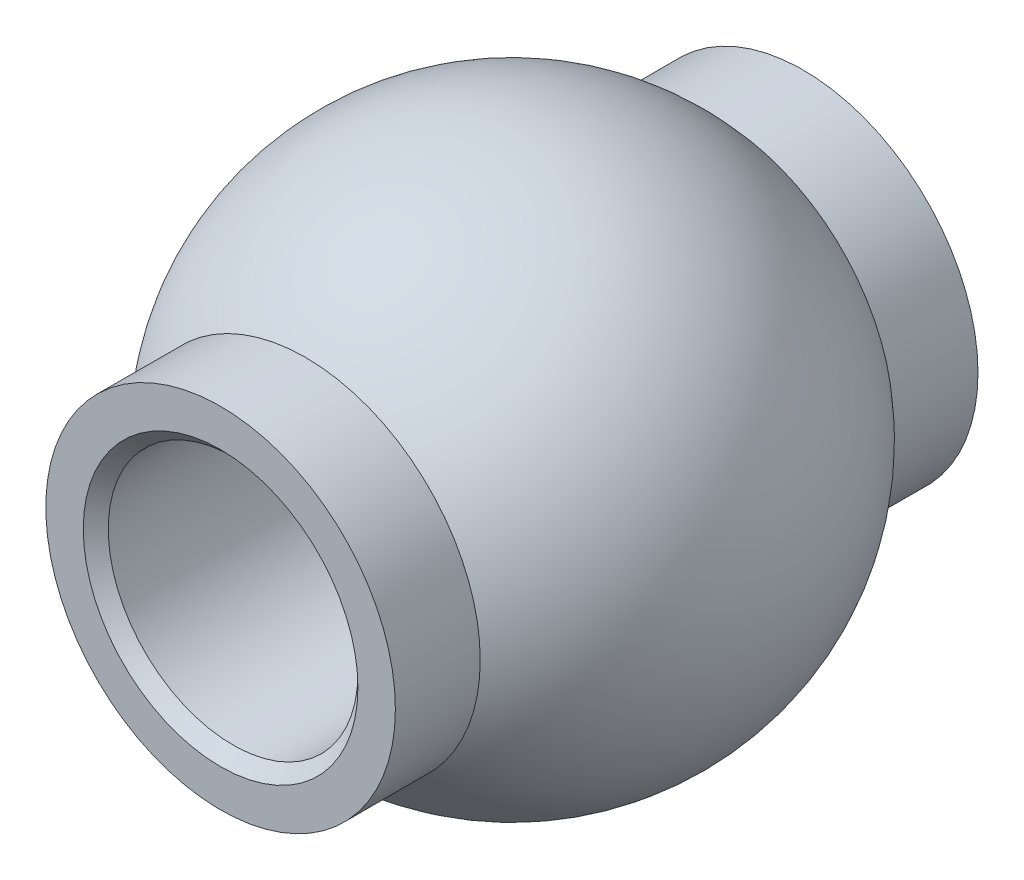
ISO-10303-21;
HEADER;
FILE_DESCRIPTION(('STEP AP214'),'2;1');
FILE_NAME('part.step','',(''),(''),'','','');
FILE_SCHEMA(('AUTOMOTIVE_DESIGN { 1 0 10303 214 1 1 1 1 }'));
ENDSEC;
DATA;
#1=APPLICATION_CONTEXT('core data for automotive mechanical design processes');
#2=APPLICATION_PROTOCOL_DEFINITION('international standard','automotive_design',2000,#1);
#3=PRODUCT_CONTEXT('',#1,'mechanical');
#4=PRODUCT('Part','Part','',(#3));
#5=PRODUCT_RELATED_PRODUCT_CATEGORY('part','',(#4));
#6=PRODUCT_DEFINITION_FORMATION('','',#4);
#7=PRODUCT_DEFINITION_CONTEXT('part definition',#1,'design');
#8=PRODUCT_DEFINITION('design','',#6,#7);
#9=PRODUCT_DEFINITION_SHAPE('','',#8);
#10=(LENGTH_UNIT() NAMED_UNIT(*) SI_UNIT(.MILLI.,.METRE.));
#11=(NAMED_UNIT(*) PLANE_ANGLE_UNIT() SI_UNIT($,.RADIAN.));
#12=(NAMED_UNIT(*) SI_UNIT($,.STERADIAN.) SOLID_ANGLE_UNIT());
#13=UNCERTAINTY_MEASURE_WITH_UNIT(LENGTH_MEASURE(1.E-05),#10,'distance_accuracy_value','');
#14=(GEOMETRIC_REPRESENTATION_CONTEXT(3) GLOBAL_UNCERTAINTY_ASSIGNED_CONTEXT((#13)) GLOBAL_UNIT_ASSIGNED_CONTEXT((#10,
#11,#12)) REPRESENTATION_CONTEXT('',''));
#15=CARTESIAN_POINT('',(0.,0.,0.));
#16=DIRECTION('',(0.,0.,1.));
#17=DIRECTION('',(1.,0.,0.));
#18=AXIS2_PLACEMENT_3D('',#15,#16,#17);
#19=CARTESIAN_POINT('',(0.,19.05,0.));
#20=DIRECTION('',(0.,-1.,0.));
#21=DIRECTION('',(-1.,0.,0.));
#22=AXIS2_PLACEMENT_3D('',#19,#20,#21);
#23=SPHERICAL_SURFACE('',#22,10.31875);
#24=CARTESIAN_POINT('',(0.,19.05,0.));
#25=DIRECTION('',(0.,0.,-1.));
#26=DIRECTION('',(-1.,0.,0.));
#27=AXIS2_PLACEMENT_3D('',#24,#25,#26);
#28=SPHERICAL_SURFACE('',#27,10.31875);
#29=CARTESIAN_POINT('',(0.,19.05,7.87534413930591));
#30=DIRECTION('',(0.,0.,-1.));
#31=DIRECTION('',(-1.,0.,0.));
#32=AXIS2_PLACEMENT_3D('',#29,#30,#31);
#33=CIRCLE('',#32,6.6675);
#34=CARTESIAN_POINT('',(-6.66750000000001,19.05,7.87534413930591));
#35=VERTEX_POINT('',#34);
#36=EDGE_CURVE('E54',#35,#35,#33,.F.);
#37=ORIENTED_EDGE('',*,*,#36,.F.);
#38=EDGE_LOOP('',(#37));
#39=FACE_BOUND('',#38,.T.);
#40=CARTESIAN_POINT('',(0.,19.05,-7.87534413930591));
#41=DIRECTION('',(0.,0.,1.));
#42=DIRECTION('',(1.,0.,0.));
#43=AXIS2_PLACEMENT_3D('',#40,#41,#42);
#44=CIRCLE('',#43,6.6675);
#45=CARTESIAN_POINT('',(6.66749999999999,19.05,-7.87534413930591));
#46=VERTEX_POINT('',#45);
#47=EDGE_CURVE('E57',#46,#46,#44,.F.);
#48=ORIENTED_EDGE('',*,*,#47,.F.);
#49=EDGE_LOOP('',(#48));
#50=FACE_BOUND('',#49,.T.);
#51=ADVANCED_FACE('F34',(#39,#50),#28,.T.);
#52=CARTESIAN_POINT('',(0.,19.05,-11.1125));
#53=DIRECTION('',(0.,0.,1.));
#54=DIRECTION('',(1.,0.,0.));
#55=AXIS2_PLACEMENT_3D('',#52,#53,#54);
#56=CYLINDRICAL_SURFACE('',#55,6.6675);
#57=ORIENTED_EDGE('',*,*,#47,.T.);
#58=EDGE_LOOP('',(#57));
#59=FACE_BOUND('',#58,.T.);
#60=CARTESIAN_POINT('',(0.,19.05,-11.1125));
#61=DIRECTION('',(0.,0.,1.));
#62=DIRECTION('',(1.,0.,0.));
#63=AXIS2_PLACEMENT_3D('',#60,#61,#62);
#64=CIRCLE('',#63,6.6675);
#65=CARTESIAN_POINT('',(6.66749999999999,19.05,-11.1125));
#66=VERTEX_POINT('',#65);
#67=EDGE_CURVE('E60',#66,#66,#64,.T.);
#68=ORIENTED_EDGE('',*,*,#67,.T.);
#69=EDGE_LOOP('',(#68));
#70=FACE_BOUND('',#69,.T.);
#71=ADVANCED_FACE('F74',(#59,#70),#56,.T.);
#72=CARTESIAN_POINT('',(0.,19.05,-11.1125));
#73=DIRECTION('',(0.,0.,1.));
#74=DIRECTION('',(1.,0.,0.));
#75=AXIS2_PLACEMENT_3D('',#72,#73,#74);
#76=PLANE('',#75);
#77=CARTESIAN_POINT('',(0.,19.05,-11.1125));
#78=DIRECTION('',(0.,0.,1.));
#79=DIRECTION('',(1.,0.,0.));
#80=AXIS2_PLACEMENT_3D('',#77,#78,#79);
#81=CIRCLE('',#80,5.23875);
#82=CARTESIAN_POINT('',(5.23874999999999,19.05,-11.1125));
#83=VERTEX_POINT('',#82);
#84=EDGE_CURVE('E49',#83,#83,#81,.T.);
#85=ORIENTED_EDGE('',*,*,#84,.T.);
#86=EDGE_LOOP('',(#85));
#87=FACE_BOUND('',#86,.T.);
#88=ORIENTED_EDGE('',*,*,#67,.F.);
#89=EDGE_LOOP('',(#88));
#90=FACE_BOUND('',#89,.T.);
#91=ADVANCED_FACE('F71',(#87,#90),#76,.F.);
#92=ORIENTED_EDGE('',*,*,#36,.T.);
#93=EDGE_LOOP('',(#92));
#94=FACE_BOUND('',#93,.T.);
#95=CARTESIAN_POINT('',(0.,19.05,11.1125));
#96=DIRECTION('',(0.,0.,1.));
#97=DIRECTION('',(1.,0.,0.));
#98=AXIS2_PLACEMENT_3D('',#95,#96,#97);
#99=CIRCLE('',#98,6.6675);
#100=CARTESIAN_POINT('',(6.66749999999999,19.05,11.1125));
#101=VERTEX_POINT('',#100);
#102=EDGE_CURVE('E63',#101,#101,#99,.T.);
#103=ORIENTED_EDGE('',*,*,#102,.F.);
#104=EDGE_LOOP('',(#103));
#105=FACE_BOUND('',#104,.T.);
#106=ADVANCED_FACE('F69',(#94,#105),#56,.T.);
#107=CARTESIAN_POINT('',(0.,19.05,11.1125));
#108=DIRECTION('',(0.,0.,1.));
#109=DIRECTION('',(1.,0.,0.));
#110=AXIS2_PLACEMENT_3D('',#107,#108,#109);
#111=PLANE('',#110);
#112=CARTESIAN_POINT('',(0.,19.05,11.1125));
#113=DIRECTION('',(0.,0.,1.));
#114=DIRECTION('',(1.,0.,0.));
#115=AXIS2_PLACEMENT_3D('',#112,#113,#114);
#116=CIRCLE('',#115,5.23875);
#117=CARTESIAN_POINT('',(5.23874999999999,19.05,11.1125));
#118=VERTEX_POINT('',#117);
#119=EDGE_CURVE('E10',#118,#118,#116,.F.);
#120=ORIENTED_EDGE('',*,*,#119,.T.);
#121=EDGE_LOOP('',(#120));
#122=FACE_BOUND('',#121,.T.);
#123=ORIENTED_EDGE('',*,*,#102,.T.);
#124=EDGE_LOOP('',(#123));
#125=FACE_BOUND('',#124,.T.);
#126=ADVANCED_FACE('F67',(#122,#125),#111,.T.);
#127=CARTESIAN_POINT('',(0.,19.05,-10.31875));
#128=DIRECTION('',(0.,0.,1.));
#129=DIRECTION('',(1.,0.,0.));
#130=AXIS2_PLACEMENT_3D('',#127,#128,#129);
#131=CYLINDRICAL_SURFACE('',#130,4.7625);
#132=CARTESIAN_POINT('',(0.,19.05,-10.63625));
#133=DIRECTION('',(0.,0.,1.));
#134=DIRECTION('',(1.,0.,0.));
#135=AXIS2_PLACEMENT_3D('',#132,#133,#134);
#136=CIRCLE('',#135,4.7625);
#137=CARTESIAN_POINT('',(4.76249999999999,19.05,-10.63625));
#138=VERTEX_POINT('',#137);
#139=EDGE_CURVE('E41',#138,#138,#136,.F.);
#140=ORIENTED_EDGE('',*,*,#139,.T.);
#141=EDGE_LOOP('',(#140));
#142=FACE_BOUND('',#141,.T.);
#143=CARTESIAN_POINT('',(0.,19.05,10.63625));
#144=DIRECTION('',(0.,0.,1.));
#145=DIRECTION('',(1.,0.,0.));
#146=AXIS2_PLACEMENT_3D('',#143,#144,#145);
#147=CIRCLE('',#146,4.7625);
#148=CARTESIAN_POINT('',(4.76249999999999,19.05,10.63625));
#149=VERTEX_POINT('',#148);
#150=EDGE_CURVE('E45',#149,#149,#147,.T.);
#151=ORIENTED_EDGE('',*,*,#150,.T.);
#152=EDGE_LOOP('',(#151));
#153=FACE_BOUND('',#152,.T.);
#154=ADVANCED_FACE('F79',(#142,#153),#131,.F.);
#155=CARTESIAN_POINT('',(0.,19.05,-11.1125));
#156=DIRECTION('',(0.,0.,-1.));
#157=DIRECTION('',(-1.,0.,0.));
#158=AXIS2_PLACEMENT_3D('',#155,#156,#157);
#159=CONICAL_SURFACE('',#158,5.23875,0.785398163397447);
#160=ORIENTED_EDGE('',*,*,#139,.F.);
#161=EDGE_LOOP('',(#160));
#162=FACE_BOUND('',#161,.T.);
#163=ORIENTED_EDGE('',*,*,#84,.F.);
#164=EDGE_LOOP('',(#163));
#165=FACE_BOUND('',#164,.T.);
#166=ADVANCED_FACE('F93',(#162,#165),#159,.F.);
#167=CARTESIAN_POINT('',(0.,19.05,10.63625));
#168=DIRECTION('',(0.,0.,1.));
#169=DIRECTION('',(1.,0.,0.));
#170=AXIS2_PLACEMENT_3D('',#167,#168,#169);
#171=CONICAL_SURFACE('',#170,4.7625,0.78539816339745);
#172=ORIENTED_EDGE('',*,*,#119,.F.);
#173=EDGE_LOOP('',(#172));
#174=FACE_BOUND('',#173,.T.);
#175=ORIENTED_EDGE('',*,*,#150,.F.);
#176=EDGE_LOOP('',(#175));
#177=FACE_BOUND('',#176,.T.);
#178=ADVANCED_FACE('F36',(#174,#177),#171,.F.);
#179=CLOSED_SHELL('',(#51,#71,#91,#106,#126,#154,#166,#178));
#180=MANIFOLD_SOLID_BREP('B2',#179);
#181=ADVANCED_BREP_SHAPE_REPRESENTATION('',(#18,#180),#14);
#182=SHAPE_DEFINITION_REPRESENTATION(#9,#181);
ENDSEC;
END-ISO-10303-21;
